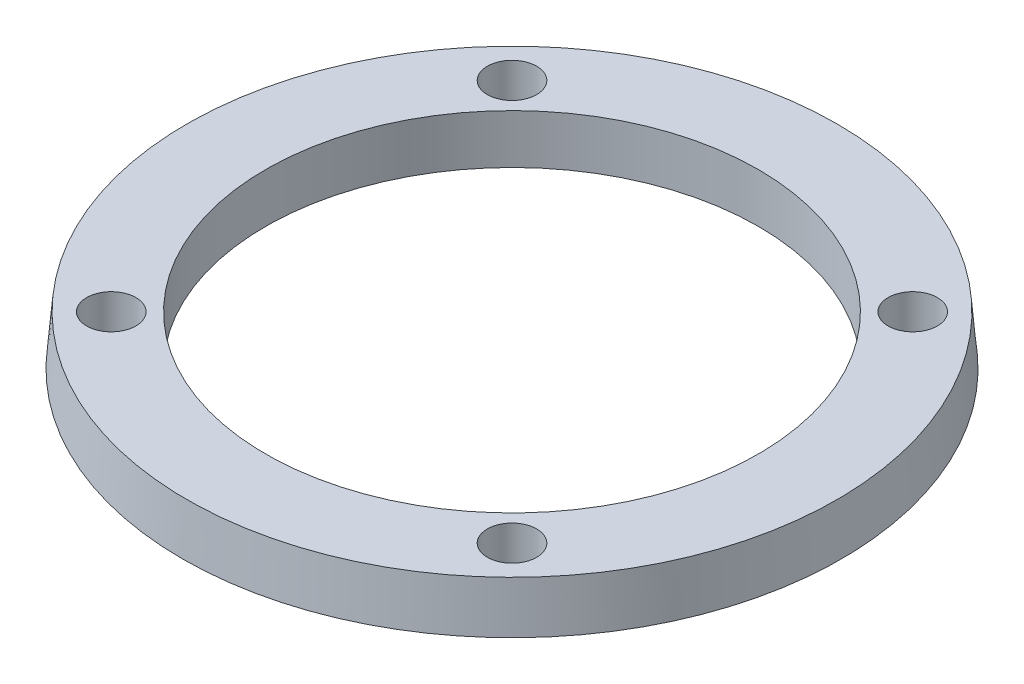
ISO-10303-21;
HEADER;
FILE_DESCRIPTION(('STEP AP214'),'2;1');
FILE_NAME('part.step','',(''),(''),'','','');
FILE_SCHEMA(('AUTOMOTIVE_DESIGN { 1 0 10303 214 1 1 1 1 }'));
ENDSEC;
DATA;
#1=APPLICATION_CONTEXT('core data for automotive mechanical design processes');
#2=APPLICATION_PROTOCOL_DEFINITION('international standard','automotive_design',2000,#1);
#3=PRODUCT_CONTEXT('',#1,'mechanical');
#4=PRODUCT('Part','Part','',(#3));
#5=PRODUCT_RELATED_PRODUCT_CATEGORY('part','',(#4));
#6=PRODUCT_DEFINITION_FORMATION('','',#4);
#7=PRODUCT_DEFINITION_CONTEXT('part definition',#1,'design');
#8=PRODUCT_DEFINITION('design','',#6,#7);
#9=PRODUCT_DEFINITION_SHAPE('','',#8);
#10=(LENGTH_UNIT() NAMED_UNIT(*) SI_UNIT(.MILLI.,.METRE.));
#11=(NAMED_UNIT(*) PLANE_ANGLE_UNIT() SI_UNIT($,.RADIAN.));
#12=(NAMED_UNIT(*) SI_UNIT($,.STERADIAN.) SOLID_ANGLE_UNIT());
#13=UNCERTAINTY_MEASURE_WITH_UNIT(LENGTH_MEASURE(1.E-05),#10,'distance_accuracy_value','');
#14=(GEOMETRIC_REPRESENTATION_CONTEXT(3) GLOBAL_UNCERTAINTY_ASSIGNED_CONTEXT((#13)) GLOBAL_UNIT_ASSIGNED_CONTEXT((#10,
#11,#12)) REPRESENTATION_CONTEXT('',''));
#15=CARTESIAN_POINT('',(0.,0.,0.));
#16=DIRECTION('',(0.,0.,1.));
#17=DIRECTION('',(1.,0.,0.));
#18=AXIS2_PLACEMENT_3D('',#15,#16,#17);
#19=CARTESIAN_POINT('',(0.,0.,0.));
#20=DIRECTION('',(0.,-1.,0.));
#21=DIRECTION('',(0.,0.,-1.));
#22=AXIS2_PLACEMENT_3D('',#19,#20,#21);
#23=CYLINDRICAL_SURFACE('',#22,20.);
#24=CARTESIAN_POINT('',(0.,4.,0.));
#25=DIRECTION('',(0.,-1.,0.));
#26=DIRECTION('',(0.,0.,-1.));
#27=AXIS2_PLACEMENT_3D('',#24,#25,#26);
#28=CIRCLE('',#27,20.);
#29=CARTESIAN_POINT('',(0.,4.,-20.));
#30=VERTEX_POINT('',#29);
#31=EDGE_CURVE('E10',#30,#30,#28,.T.);
#32=ORIENTED_EDGE('',*,*,#31,.F.);
#33=EDGE_LOOP('',(#32));
#34=FACE_BOUND('',#33,.T.);
#35=CARTESIAN_POINT('',(0.,0.,0.));
#36=DIRECTION('',(0.,-1.,0.));
#37=DIRECTION('',(0.,0.,-1.));
#38=AXIS2_PLACEMENT_3D('',#35,#36,#37);
#39=CIRCLE('',#38,20.);
#40=CARTESIAN_POINT('',(0.,0.,-20.));
#41=VERTEX_POINT('',#40);
#42=EDGE_CURVE('E46',#41,#41,#39,.T.);
#43=ORIENTED_EDGE('',*,*,#42,.T.);
#44=EDGE_LOOP('',(#43));
#45=FACE_BOUND('',#44,.T.);
#46=ADVANCED_FACE('F32',(#34,#45),#23,.F.);
#47=CARTESIAN_POINT('',(-20.,4.,0.));
#48=DIRECTION('',(0.,-1.,0.));
#49=DIRECTION('',(0.,0.,-1.));
#50=AXIS2_PLACEMENT_3D('',#47,#48,#49);
#51=PLANE('',#50);
#52=CARTESIAN_POINT('',(16.2634559672908,4.,16.2634559672907));
#53=DIRECTION('',(0.,-1.,0.));
#54=DIRECTION('',(0.,0.,-1.));
#55=AXIS2_PLACEMENT_3D('',#52,#53,#54);
#56=CIRCLE('',#55,2.);
#57=CARTESIAN_POINT('',(16.2634559672908,4.,14.2634559672907));
#58=VERTEX_POINT('',#57);
#59=EDGE_CURVE('E55',#58,#58,#56,.T.);
#60=ORIENTED_EDGE('',*,*,#59,.T.);
#61=EDGE_LOOP('',(#60));
#62=FACE_BOUND('',#61,.T.);
#63=CARTESIAN_POINT('',(-16.2634559672906,4.,-16.2634559672905));
#64=DIRECTION('',(0.,-1.,0.));
#65=DIRECTION('',(0.,0.,-1.));
#66=AXIS2_PLACEMENT_3D('',#63,#64,#65);
#67=CIRCLE('',#66,2.);
#68=CARTESIAN_POINT('',(-16.2634559672906,4.,-18.2634559672905));
#69=VERTEX_POINT('',#68);
#70=EDGE_CURVE('E67',#69,#69,#67,.T.);
#71=ORIENTED_EDGE('',*,*,#70,.T.);
#72=EDGE_LOOP('',(#71));
#73=FACE_BOUND('',#72,.T.);
#74=CARTESIAN_POINT('',(16.2634559672905,4.,-16.2634559672905));
#75=DIRECTION('',(0.,-1.,0.));
#76=DIRECTION('',(0.,0.,-1.));
#77=AXIS2_PLACEMENT_3D('',#74,#75,#76);
#78=CIRCLE('',#77,2.00000000000001);
#79=CARTESIAN_POINT('',(16.2634559672905,4.,-18.2634559672905));
#80=VERTEX_POINT('',#79);
#81=EDGE_CURVE('E61',#80,#80,#78,.T.);
#82=ORIENTED_EDGE('',*,*,#81,.T.);
#83=EDGE_LOOP('',(#82));
#84=FACE_BOUND('',#83,.T.);
#85=CARTESIAN_POINT('',(-16.2634559672906,4.,16.2634559672907));
#86=DIRECTION('',(0.,-1.,0.));
#87=DIRECTION('',(0.,0.,-1.));
#88=AXIS2_PLACEMENT_3D('',#85,#86,#87);
#89=CIRCLE('',#88,2.);
#90=CARTESIAN_POINT('',(-16.2634559672906,4.,14.2634559672907));
#91=VERTEX_POINT('',#90);
#92=EDGE_CURVE('E51',#91,#91,#89,.T.);
#93=ORIENTED_EDGE('',*,*,#92,.T.);
#94=EDGE_LOOP('',(#93));
#95=FACE_BOUND('',#94,.T.);
#96=CARTESIAN_POINT('',(0.,4.,0.));
#97=DIRECTION('',(0.,-1.,0.));
#98=DIRECTION('',(0.,0.,-1.));
#99=AXIS2_PLACEMENT_3D('',#96,#97,#98);
#100=CIRCLE('',#99,26.4000453458963);
#101=CARTESIAN_POINT('',(0.,4.,-26.4000453458963));
#102=VERTEX_POINT('',#101);
#103=EDGE_CURVE('E38',#102,#102,#100,.T.);
#104=ORIENTED_EDGE('',*,*,#103,.F.);
#105=EDGE_LOOP('',(#104));
#106=FACE_BOUND('',#105,.T.);
#107=ORIENTED_EDGE('',*,*,#31,.T.);
#108=EDGE_LOOP('',(#107));
#109=FACE_BOUND('',#108,.T.);
#110=ADVANCED_FACE('F76',(#62,#73,#84,#95,#106,#109),#51,.F.);
#111=CARTESIAN_POINT('',(0.,4.,0.));
#112=DIRECTION('',(0.,-1.,0.));
#113=DIRECTION('',(0.,0.,-1.));
#114=AXIS2_PLACEMENT_3D('',#111,#112,#113);
#115=CONICAL_SURFACE('',#114,26.4000453458963,0.0872664625997169);
#116=CARTESIAN_POINT('',(0.,0.,0.));
#117=DIRECTION('',(0.,-1.,0.));
#118=DIRECTION('',(0.,0.,-1.));
#119=AXIS2_PLACEMENT_3D('',#116,#117,#118);
#120=CIRCLE('',#119,26.75);
#121=CARTESIAN_POINT('',(0.,0.,-26.75));
#122=VERTEX_POINT('',#121);
#123=EDGE_CURVE('E42',#122,#122,#120,.T.);
#124=ORIENTED_EDGE('',*,*,#123,.F.);
#125=EDGE_LOOP('',(#124));
#126=FACE_BOUND('',#125,.T.);
#127=ORIENTED_EDGE('',*,*,#103,.T.);
#128=EDGE_LOOP('',(#127));
#129=FACE_BOUND('',#128,.T.);
#130=ADVANCED_FACE('F90',(#126,#129),#115,.T.);
#131=CARTESIAN_POINT('',(-20.,0.,0.));
#132=DIRECTION('',(0.,1.,0.));
#133=DIRECTION('',(0.,0.,1.));
#134=AXIS2_PLACEMENT_3D('',#131,#132,#133);
#135=PLANE('',#134);
#136=CARTESIAN_POINT('',(16.2634559672908,0.,16.2634559672907));
#137=DIRECTION('',(0.,-1.,0.));
#138=DIRECTION('',(0.,0.,-1.));
#139=AXIS2_PLACEMENT_3D('',#136,#137,#138);
#140=CIRCLE('',#139,2.);
#141=CARTESIAN_POINT('',(16.2634559672908,0.,14.2634559672907));
#142=VERTEX_POINT('',#141);
#143=EDGE_CURVE('E70',#142,#142,#140,.T.);
#144=ORIENTED_EDGE('',*,*,#143,.F.);
#145=EDGE_LOOP('',(#144));
#146=FACE_BOUND('',#145,.T.);
#147=CARTESIAN_POINT('',(-16.2634559672906,0.,-16.2634559672905));
#148=DIRECTION('',(0.,-1.,0.));
#149=DIRECTION('',(0.,0.,-1.));
#150=AXIS2_PLACEMENT_3D('',#147,#148,#149);
#151=CIRCLE('',#150,2.);
#152=CARTESIAN_POINT('',(-16.2634559672906,0.,-18.2634559672905));
#153=VERTEX_POINT('',#152);
#154=EDGE_CURVE('E64',#153,#153,#151,.T.);
#155=ORIENTED_EDGE('',*,*,#154,.F.);
#156=EDGE_LOOP('',(#155));
#157=FACE_BOUND('',#156,.T.);
#158=CARTESIAN_POINT('',(16.2634559672905,0.,-16.2634559672905));
#159=DIRECTION('',(0.,-1.,0.));
#160=DIRECTION('',(0.,0.,-1.));
#161=AXIS2_PLACEMENT_3D('',#158,#159,#160);
#162=CIRCLE('',#161,2.00000000000001);
#163=CARTESIAN_POINT('',(16.2634559672905,0.,-18.2634559672905));
#164=VERTEX_POINT('',#163);
#165=EDGE_CURVE('E58',#164,#164,#162,.T.);
#166=ORIENTED_EDGE('',*,*,#165,.F.);
#167=EDGE_LOOP('',(#166));
#168=FACE_BOUND('',#167,.T.);
#169=CARTESIAN_POINT('',(-16.2634559672906,0.,16.2634559672907));
#170=DIRECTION('',(0.,-1.,0.));
#171=DIRECTION('',(0.,0.,-1.));
#172=AXIS2_PLACEMENT_3D('',#169,#170,#171);
#173=CIRCLE('',#172,2.);
#174=CARTESIAN_POINT('',(-16.2634559672906,0.,14.2634559672907));
#175=VERTEX_POINT('',#174);
#176=EDGE_CURVE('E52',#175,#175,#173,.T.);
#177=ORIENTED_EDGE('',*,*,#176,.F.);
#178=EDGE_LOOP('',(#177));
#179=FACE_BOUND('',#178,.T.);
#180=ORIENTED_EDGE('',*,*,#42,.F.);
#181=EDGE_LOOP('',(#180));
#182=FACE_BOUND('',#181,.T.);
#183=ORIENTED_EDGE('',*,*,#123,.T.);
#184=EDGE_LOOP('',(#183));
#185=FACE_BOUND('',#184,.T.);
#186=ADVANCED_FACE('F86',(#146,#157,#168,#179,#182,#185),#135,.F.);
#187=CARTESIAN_POINT('',(-16.2634559672906,4.,16.2634559672907));
#188=DIRECTION('',(0.,-1.,0.));
#189=DIRECTION('',(0.,0.,-1.));
#190=AXIS2_PLACEMENT_3D('',#187,#188,#189);
#191=CYLINDRICAL_SURFACE('',#190,2.);
#192=ORIENTED_EDGE('',*,*,#92,.F.);
#193=EDGE_LOOP('',(#192));
#194=FACE_BOUND('',#193,.T.);
#195=ORIENTED_EDGE('',*,*,#176,.T.);
#196=EDGE_LOOP('',(#195));
#197=FACE_BOUND('',#196,.T.);
#198=ADVANCED_FACE('F89',(#194,#197),#191,.F.);
#199=CARTESIAN_POINT('',(16.2634559672905,4.,-16.2634559672905));
#200=DIRECTION('',(0.,-1.,0.));
#201=DIRECTION('',(0.,0.,-1.));
#202=AXIS2_PLACEMENT_3D('',#199,#200,#201);
#203=CYLINDRICAL_SURFACE('',#202,2.00000000000001);
#204=ORIENTED_EDGE('',*,*,#81,.F.);
#205=EDGE_LOOP('',(#204));
#206=FACE_BOUND('',#205,.T.);
#207=ORIENTED_EDGE('',*,*,#165,.T.);
#208=EDGE_LOOP('',(#207));
#209=FACE_BOUND('',#208,.T.);
#210=ADVANCED_FACE('F133',(#206,#209),#203,.F.);
#211=CARTESIAN_POINT('',(-16.2634559672906,4.,-16.2634559672905));
#212=DIRECTION('',(0.,-1.,0.));
#213=DIRECTION('',(0.,0.,-1.));
#214=AXIS2_PLACEMENT_3D('',#211,#212,#213);
#215=CYLINDRICAL_SURFACE('',#214,2.);
#216=ORIENTED_EDGE('',*,*,#70,.F.);
#217=EDGE_LOOP('',(#216));
#218=FACE_BOUND('',#217,.T.);
#219=ORIENTED_EDGE('',*,*,#154,.T.);
#220=EDGE_LOOP('',(#219));
#221=FACE_BOUND('',#220,.T.);
#222=ADVANCED_FACE('F82',(#218,#221),#215,.F.);
#223=CARTESIAN_POINT('',(16.2634559672908,4.,16.2634559672907));
#224=DIRECTION('',(0.,-1.,0.));
#225=DIRECTION('',(0.,0.,-1.));
#226=AXIS2_PLACEMENT_3D('',#223,#224,#225);
#227=CYLINDRICAL_SURFACE('',#226,2.);
#228=ORIENTED_EDGE('',*,*,#59,.F.);
#229=EDGE_LOOP('',(#228));
#230=FACE_BOUND('',#229,.T.);
#231=ORIENTED_EDGE('',*,*,#143,.T.);
#232=EDGE_LOOP('',(#231));
#233=FACE_BOUND('',#232,.T.);
#234=ADVANCED_FACE('F79',(#230,#233),#227,.F.);
#235=CLOSED_SHELL('',(#46,#110,#130,#186,#198,#210,#222,#234));
#236=MANIFOLD_SOLID_BREP('B2',#235);
#237=ADVANCED_BREP_SHAPE_REPRESENTATION('',(#18,#236),#14);
#238=SHAPE_DEFINITION_REPRESENTATION(#9,#237);
ENDSEC;
END-ISO-10303-21;
